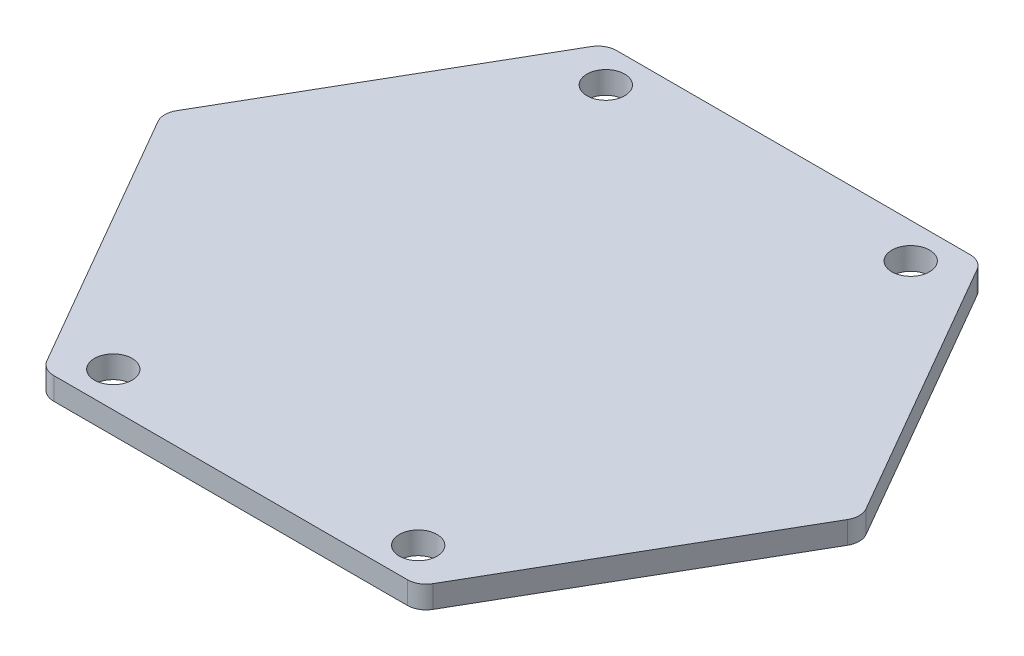
ISO-10303-21;
HEADER;
FILE_DESCRIPTION(('STEP AP214'),'2;1');
FILE_NAME('part.step','',(''),(''),'','','');
FILE_SCHEMA(('AUTOMOTIVE_DESIGN { 1 0 10303 214 1 1 1 1 }'));
ENDSEC;
DATA;
#1=APPLICATION_CONTEXT('core data for automotive mechanical design processes');
#2=APPLICATION_PROTOCOL_DEFINITION('international standard','automotive_design',2000,#1);
#3=PRODUCT_CONTEXT('',#1,'mechanical');
#4=PRODUCT('Part','Part','',(#3));
#5=PRODUCT_RELATED_PRODUCT_CATEGORY('part','',(#4));
#6=PRODUCT_DEFINITION_FORMATION('','',#4);
#7=PRODUCT_DEFINITION_CONTEXT('part definition',#1,'design');
#8=PRODUCT_DEFINITION('design','',#6,#7);
#9=PRODUCT_DEFINITION_SHAPE('','',#8);
#10=(LENGTH_UNIT() NAMED_UNIT(*) SI_UNIT(.MILLI.,.METRE.));
#11=(NAMED_UNIT(*) PLANE_ANGLE_UNIT() SI_UNIT($,.RADIAN.));
#12=(NAMED_UNIT(*) SI_UNIT($,.STERADIAN.) SOLID_ANGLE_UNIT());
#13=UNCERTAINTY_MEASURE_WITH_UNIT(LENGTH_MEASURE(1.E-05),#10,'distance_accuracy_value','');
#14=(GEOMETRIC_REPRESENTATION_CONTEXT(3) GLOBAL_UNCERTAINTY_ASSIGNED_CONTEXT((#13)) GLOBAL_UNIT_ASSIGNED_CONTEXT((#10,
#11,#12)) REPRESENTATION_CONTEXT('',''));
#15=CARTESIAN_POINT('',(0.,0.,0.));
#16=DIRECTION('',(0.,0.,1.));
#17=DIRECTION('',(1.,0.,0.));
#18=AXIS2_PLACEMENT_3D('',#15,#16,#17);
#19=CARTESIAN_POINT('',(0.,31.8516,0.));
#20=DIRECTION('',(0.,1.,0.));
#21=DIRECTION('',(0.,0.,1.));
#22=AXIS2_PLACEMENT_3D('',#19,#20,#21);
#23=PLANE('',#22);
#24=CARTESIAN_POINT('',(-20.6375,31.8516,138.2395));
#25=DIRECTION('',(0.,1.,0.));
#26=DIRECTION('',(0.,0.,1.));
#27=AXIS2_PLACEMENT_3D('',#24,#25,#26);
#28=CIRCLE('',#27,2.5527);
#29=CARTESIAN_POINT('',(-20.6375,31.8516,140.7922));
#30=VERTEX_POINT('',#29);
#31=EDGE_CURVE('E337',#30,#30,#28,.T.);
#32=ORIENTED_EDGE('',*,*,#31,.F.);
#33=EDGE_LOOP('',(#32));
#34=FACE_BOUND('',#33,.T.);
#35=CARTESIAN_POINT('',(20.6375,31.8516,71.5645));
#36=DIRECTION('',(0.,1.,0.));
#37=DIRECTION('',(0.,0.,1.));
#38=AXIS2_PLACEMENT_3D('',#35,#36,#37);
#39=CIRCLE('',#38,2.5527);
#40=CARTESIAN_POINT('',(20.6375,31.8516,74.1172));
#41=VERTEX_POINT('',#40);
#42=EDGE_CURVE('E270',#41,#41,#39,.T.);
#43=ORIENTED_EDGE('',*,*,#42,.F.);
#44=EDGE_LOOP('',(#43));
#45=FACE_BOUND('',#44,.T.);
#46=DIRECTION('',(-0.500000000000001,0.,0.866025403784438));
#47=VECTOR('',#46,1.);
#48=CARTESIAN_POINT('',(-47.3970452561248,31.8516,104.902));
#49=LINE('',#48,#47);
#50=CARTESIAN_POINT('',(-26.1332348418708,31.8516,68.072));
#51=VERTEX_POINT('',#50);
#52=CARTESIAN_POINT('',(-46.663810414254,31.8516,103.632));
#53=VERTEX_POINT('',#52);
#54=EDGE_CURVE('E259',#51,#53,#49,.T.);
#55=ORIENTED_EDGE('',*,*,#54,.T.);
#56=CARTESIAN_POINT('',(-44.4641058886415,31.8516,104.902));
#57=DIRECTION('',(0.,1.,0.));
#58=DIRECTION('',(0.,0.,1.));
#59=AXIS2_PLACEMENT_3D('',#56,#57,#58);
#60=CIRCLE('',#59,2.54);
#61=CARTESIAN_POINT('',(-46.663810414254,31.8516,106.172));
#62=VERTEX_POINT('',#61);
#63=EDGE_CURVE('E204',#53,#62,#60,.T.);
#64=ORIENTED_EDGE('',*,*,#63,.T.);
#65=DIRECTION('',(0.500000000000001,0.,0.866025403784438));
#66=VECTOR('',#65,1.);
#67=CARTESIAN_POINT('',(-25.4,31.8516,143.002));
#68=LINE('',#67,#66);
#69=CARTESIAN_POINT('',(-26.1332348418708,31.8516,141.732));
#70=VERTEX_POINT('',#69);
#71=EDGE_CURVE('E149',#62,#70,#68,.T.);
#72=ORIENTED_EDGE('',*,*,#71,.T.);
#73=CARTESIAN_POINT('',(-23.9335303162583,31.8516,140.462));
#74=DIRECTION('',(0.,1.,0.));
#75=DIRECTION('',(0.,0.,1.));
#76=AXIS2_PLACEMENT_3D('',#73,#74,#75);
#77=CIRCLE('',#76,2.54);
#78=CARTESIAN_POINT('',(-23.9335303162583,31.8516,143.002));
#79=VERTEX_POINT('',#78);
#80=EDGE_CURVE('E60',#70,#79,#77,.T.);
#81=ORIENTED_EDGE('',*,*,#80,.T.);
#82=DIRECTION('',(1.,0.,0.));
#83=VECTOR('',#82,1.);
#84=CARTESIAN_POINT('',(-25.4,31.8516,143.002));
#85=LINE('',#84,#83);
#86=CARTESIAN_POINT('',(23.9335303162583,31.8516,143.002));
#87=VERTEX_POINT('',#86);
#88=EDGE_CURVE('E170',#79,#87,#85,.T.);
#89=ORIENTED_EDGE('',*,*,#88,.T.);
#90=CARTESIAN_POINT('',(23.9335303162583,31.8516,140.462));
#91=DIRECTION('',(0.,1.,0.));
#92=DIRECTION('',(0.,0.,1.));
#93=AXIS2_PLACEMENT_3D('',#90,#91,#92);
#94=CIRCLE('',#93,2.54);
#95=CARTESIAN_POINT('',(26.1332348418708,31.8516,141.732));
#96=VERTEX_POINT('',#95);
#97=EDGE_CURVE('E192',#87,#96,#94,.T.);
#98=ORIENTED_EDGE('',*,*,#97,.T.);
#99=DIRECTION('',(0.500000000000001,0.,-0.866025403784438));
#100=VECTOR('',#99,1.);
#101=CARTESIAN_POINT('',(47.3970452561248,31.8516,104.902));
#102=LINE('',#101,#100);
#103=CARTESIAN_POINT('',(46.663810414254,31.8516,106.172));
#104=VERTEX_POINT('',#103);
#105=EDGE_CURVE('E163',#96,#104,#102,.T.);
#106=ORIENTED_EDGE('',*,*,#105,.T.);
#107=CARTESIAN_POINT('',(44.4641058886415,31.8516,104.902));
#108=DIRECTION('',(0.,1.,0.));
#109=DIRECTION('',(0.,0.,1.));
#110=AXIS2_PLACEMENT_3D('',#107,#108,#109);
#111=CIRCLE('',#110,2.54);
#112=CARTESIAN_POINT('',(46.663810414254,31.8516,103.632));
#113=VERTEX_POINT('',#112);
#114=EDGE_CURVE('E195',#104,#113,#111,.T.);
#115=ORIENTED_EDGE('',*,*,#114,.T.);
#116=DIRECTION('',(-0.500000000000001,0.,-0.866025403784438));
#117=VECTOR('',#116,1.);
#118=CARTESIAN_POINT('',(25.4,31.8516,66.802));
#119=LINE('',#118,#117);
#120=CARTESIAN_POINT('',(26.1332348418708,31.8516,68.072));
#121=VERTEX_POINT('',#120);
#122=EDGE_CURVE('E246',#113,#121,#119,.T.);
#123=ORIENTED_EDGE('',*,*,#122,.T.);
#124=CARTESIAN_POINT('',(23.9335303162583,31.8516,69.342));
#125=DIRECTION('',(0.,1.,0.));
#126=DIRECTION('',(0.,0.,1.));
#127=AXIS2_PLACEMENT_3D('',#124,#125,#126);
#128=CIRCLE('',#127,2.54);
#129=CARTESIAN_POINT('',(23.9335303162583,31.8516,66.802));
#130=VERTEX_POINT('',#129);
#131=EDGE_CURVE('E198',#121,#130,#128,.T.);
#132=ORIENTED_EDGE('',*,*,#131,.T.);
#133=DIRECTION('',(-1.,0.,0.));
#134=VECTOR('',#133,1.);
#135=CARTESIAN_POINT('',(-25.4,31.8516,66.802));
#136=LINE('',#135,#134);
#137=CARTESIAN_POINT('',(-23.9335303162584,31.8516,66.802));
#138=VERTEX_POINT('',#137);
#139=EDGE_CURVE('E250',#130,#138,#136,.T.);
#140=ORIENTED_EDGE('',*,*,#139,.T.);
#141=CARTESIAN_POINT('',(-23.9335303162584,31.8516,69.342));
#142=DIRECTION('',(0.,1.,0.));
#143=DIRECTION('',(0.,0.,1.));
#144=AXIS2_PLACEMENT_3D('',#141,#142,#143);
#145=CIRCLE('',#144,2.54);
#146=EDGE_CURVE('E201',#138,#51,#145,.T.);
#147=ORIENTED_EDGE('',*,*,#146,.T.);
#148=EDGE_LOOP('',(#55,#64,#72,#81,#89,#98,#106,#115,#123,#132,#140,#147));
#149=FACE_BOUND('',#148,.T.);
#150=CARTESIAN_POINT('',(-20.6375,31.8516,71.5645));
#151=DIRECTION('',(0.,1.,0.));
#152=DIRECTION('',(0.,0.,1.));
#153=AXIS2_PLACEMENT_3D('',#150,#151,#152);
#154=CIRCLE('',#153,2.5527);
#155=CARTESIAN_POINT('',(-20.6375,31.8516,74.1172));
#156=VERTEX_POINT('',#155);
#157=EDGE_CURVE('E328',#156,#156,#154,.T.);
#158=ORIENTED_EDGE('',*,*,#157,.F.);
#159=EDGE_LOOP('',(#158));
#160=FACE_BOUND('',#159,.T.);
#161=CARTESIAN_POINT('',(20.6375,31.8516,138.2395));
#162=DIRECTION('',(0.,1.,0.));
#163=DIRECTION('',(0.,0.,1.));
#164=AXIS2_PLACEMENT_3D('',#161,#162,#163);
#165=CIRCLE('',#164,2.5527);
#166=CARTESIAN_POINT('',(20.6375,31.8516,140.7922));
#167=VERTEX_POINT('',#166);
#168=EDGE_CURVE('E344',#167,#167,#165,.T.);
#169=ORIENTED_EDGE('',*,*,#168,.F.);
#170=EDGE_LOOP('',(#169));
#171=FACE_BOUND('',#170,.T.);
#172=ADVANCED_FACE('F39',(#34,#45,#149,#160,#171),#23,.T.);
#173=CARTESIAN_POINT('',(0.,28.829,0.));
#174=DIRECTION('',(0.,1.,0.));
#175=DIRECTION('',(0.,0.,1.));
#176=AXIS2_PLACEMENT_3D('',#173,#174,#175);
#177=PLANE('',#176);
#178=DIRECTION('',(0.500000000000001,0.,0.866025403784438));
#179=VECTOR('',#178,1.);
#180=CARTESIAN_POINT('',(-25.4,28.829,143.002));
#181=LINE('',#180,#179);
#182=CARTESIAN_POINT('',(-46.663810414254,28.829,106.172));
#183=VERTEX_POINT('',#182);
#184=CARTESIAN_POINT('',(-26.1332348418708,28.829,141.732));
#185=VERTEX_POINT('',#184);
#186=EDGE_CURVE('E147',#183,#185,#181,.T.);
#187=ORIENTED_EDGE('',*,*,#186,.F.);
#188=CARTESIAN_POINT('',(-44.4641058886415,28.829,104.902));
#189=DIRECTION('',(0.,1.,0.));
#190=DIRECTION('',(0.,0.,1.));
#191=AXIS2_PLACEMENT_3D('',#188,#189,#190);
#192=CIRCLE('',#191,2.54);
#193=CARTESIAN_POINT('',(-46.663810414254,28.829,103.632));
#194=VERTEX_POINT('',#193);
#195=EDGE_CURVE('E129',#183,#194,#192,.F.);
#196=ORIENTED_EDGE('',*,*,#195,.T.);
#197=DIRECTION('',(-0.500000000000001,0.,0.866025403784438));
#198=VECTOR('',#197,1.);
#199=CARTESIAN_POINT('',(-47.3970452561248,28.829,104.902));
#200=LINE('',#199,#198);
#201=CARTESIAN_POINT('',(-26.1332348418708,28.829,68.072));
#202=VERTEX_POINT('',#201);
#203=EDGE_CURVE('E159',#202,#194,#200,.T.);
#204=ORIENTED_EDGE('',*,*,#203,.F.);
#205=CARTESIAN_POINT('',(-23.9335303162584,28.829,69.342));
#206=DIRECTION('',(0.,1.,0.));
#207=DIRECTION('',(0.,0.,1.));
#208=AXIS2_PLACEMENT_3D('',#205,#206,#207);
#209=CIRCLE('',#208,2.54);
#210=CARTESIAN_POINT('',(-23.9335303162584,28.829,66.802));
#211=VERTEX_POINT('',#210);
#212=EDGE_CURVE('E141',#202,#211,#209,.F.);
#213=ORIENTED_EDGE('',*,*,#212,.T.);
#214=DIRECTION('',(-1.,0.,0.));
#215=VECTOR('',#214,1.);
#216=CARTESIAN_POINT('',(-25.4,28.829,66.802));
#217=LINE('',#216,#215);
#218=CARTESIAN_POINT('',(23.9335303162583,28.829,66.802));
#219=VERTEX_POINT('',#218);
#220=EDGE_CURVE('E165',#219,#211,#217,.T.);
#221=ORIENTED_EDGE('',*,*,#220,.F.);
#222=CARTESIAN_POINT('',(23.9335303162583,28.829,69.342));
#223=DIRECTION('',(0.,1.,0.));
#224=DIRECTION('',(0.,0.,1.));
#225=AXIS2_PLACEMENT_3D('',#222,#223,#224);
#226=CIRCLE('',#225,2.54);
#227=CARTESIAN_POINT('',(26.1332348418708,28.829,68.072));
#228=VERTEX_POINT('',#227);
#229=EDGE_CURVE('E180',#219,#228,#226,.F.);
#230=ORIENTED_EDGE('',*,*,#229,.T.);
#231=DIRECTION('',(-0.500000000000001,0.,-0.866025403784438));
#232=VECTOR('',#231,1.);
#233=CARTESIAN_POINT('',(25.4,28.829,66.802));
#234=LINE('',#233,#232);
#235=CARTESIAN_POINT('',(46.663810414254,28.829,103.632));
#236=VERTEX_POINT('',#235);
#237=EDGE_CURVE('E269',#236,#228,#234,.T.);
#238=ORIENTED_EDGE('',*,*,#237,.F.);
#239=CARTESIAN_POINT('',(44.4641058886415,28.829,104.902));
#240=DIRECTION('',(0.,1.,0.));
#241=DIRECTION('',(0.,0.,1.));
#242=AXIS2_PLACEMENT_3D('',#239,#240,#241);
#243=CIRCLE('',#242,2.54);
#244=CARTESIAN_POINT('',(46.663810414254,28.829,106.172));
#245=VERTEX_POINT('',#244);
#246=EDGE_CURVE('E177',#236,#245,#243,.F.);
#247=ORIENTED_EDGE('',*,*,#246,.T.);
#248=DIRECTION('',(0.500000000000001,0.,-0.866025403784438));
#249=VECTOR('',#248,1.);
#250=CARTESIAN_POINT('',(47.3970452561248,28.829,104.902));
#251=LINE('',#250,#249);
#252=CARTESIAN_POINT('',(26.1332348418708,28.829,141.732));
#253=VERTEX_POINT('',#252);
#254=EDGE_CURVE('E234',#253,#245,#251,.T.);
#255=ORIENTED_EDGE('',*,*,#254,.F.);
#256=CARTESIAN_POINT('',(23.9335303162583,28.829,140.462));
#257=DIRECTION('',(0.,1.,0.));
#258=DIRECTION('',(0.,0.,1.));
#259=AXIS2_PLACEMENT_3D('',#256,#257,#258);
#260=CIRCLE('',#259,2.54);
#261=CARTESIAN_POINT('',(23.9335303162583,28.829,143.002));
#262=VERTEX_POINT('',#261);
#263=EDGE_CURVE('E174',#253,#262,#260,.F.);
#264=ORIENTED_EDGE('',*,*,#263,.T.);
#265=DIRECTION('',(1.,0.,0.));
#266=VECTOR('',#265,1.);
#267=CARTESIAN_POINT('',(-25.4,28.829,143.002));
#268=LINE('',#267,#266);
#269=CARTESIAN_POINT('',(-23.9335303162583,28.829,143.002));
#270=VERTEX_POINT('',#269);
#271=EDGE_CURVE('E158',#270,#262,#268,.T.);
#272=ORIENTED_EDGE('',*,*,#271,.F.);
#273=CARTESIAN_POINT('',(-23.9335303162583,28.829,140.462));
#274=DIRECTION('',(0.,1.,0.));
#275=DIRECTION('',(0.,0.,1.));
#276=AXIS2_PLACEMENT_3D('',#273,#274,#275);
#277=CIRCLE('',#276,2.54);
#278=EDGE_CURVE('E151',#270,#185,#277,.F.);
#279=ORIENTED_EDGE('',*,*,#278,.T.);
#280=EDGE_LOOP('',(#187,#196,#204,#213,#221,#230,#238,#247,#255,#264,#272,#279));
#281=FACE_BOUND('',#280,.T.);
#282=CARTESIAN_POINT('',(20.6375,28.829,71.5645));
#283=DIRECTION('',(0.,1.,0.));
#284=DIRECTION('',(0.,0.,1.));
#285=AXIS2_PLACEMENT_3D('',#282,#283,#284);
#286=CIRCLE('',#285,2.5527);
#287=CARTESIAN_POINT('',(20.6375,28.829,74.1172));
#288=VERTEX_POINT('',#287);
#289=EDGE_CURVE('E253',#288,#288,#286,.T.);
#290=ORIENTED_EDGE('',*,*,#289,.T.);
#291=EDGE_LOOP('',(#290));
#292=FACE_BOUND('',#291,.T.);
#293=CARTESIAN_POINT('',(-20.6375,28.829,71.5645));
#294=DIRECTION('',(0.,1.,0.));
#295=DIRECTION('',(0.,0.,1.));
#296=AXIS2_PLACEMENT_3D('',#293,#294,#295);
#297=CIRCLE('',#296,2.5527);
#298=CARTESIAN_POINT('',(-20.6375,28.829,74.1172));
#299=VERTEX_POINT('',#298);
#300=EDGE_CURVE('E332',#299,#299,#297,.T.);
#301=ORIENTED_EDGE('',*,*,#300,.T.);
#302=EDGE_LOOP('',(#301));
#303=FACE_BOUND('',#302,.T.);
#304=CARTESIAN_POINT('',(-20.6375,28.829,138.2395));
#305=DIRECTION('',(0.,1.,0.));
#306=DIRECTION('',(0.,0.,1.));
#307=AXIS2_PLACEMENT_3D('',#304,#305,#306);
#308=CIRCLE('',#307,2.5527);
#309=CARTESIAN_POINT('',(-20.6375,28.829,140.7922));
#310=VERTEX_POINT('',#309);
#311=EDGE_CURVE('E340',#310,#310,#308,.T.);
#312=ORIENTED_EDGE('',*,*,#311,.T.);
#313=EDGE_LOOP('',(#312));
#314=FACE_BOUND('',#313,.T.);
#315=CARTESIAN_POINT('',(20.6375,28.829,138.2395));
#316=DIRECTION('',(0.,1.,0.));
#317=DIRECTION('',(0.,0.,1.));
#318=AXIS2_PLACEMENT_3D('',#315,#316,#317);
#319=CIRCLE('',#318,2.5527);
#320=CARTESIAN_POINT('',(20.6375,28.829,140.7922));
#321=VERTEX_POINT('',#320);
#322=EDGE_CURVE('E348',#321,#321,#319,.T.);
#323=ORIENTED_EDGE('',*,*,#322,.T.);
#324=EDGE_LOOP('',(#323));
#325=FACE_BOUND('',#324,.T.);
#326=ADVANCED_FACE('F154',(#281,#292,#303,#314,#325),#177,.F.);
#327=CARTESIAN_POINT('',(47.3970452561248,31.8516,104.902));
#328=DIRECTION('',(-0.866025403784438,0.,-0.500000000000001));
#329=DIRECTION('',(-0.500000000000001,0.,0.866025403784438));
#330=AXIS2_PLACEMENT_3D('',#327,#328,#329);
#331=PLANE('',#330);
#332=ORIENTED_EDGE('',*,*,#254,.T.);
#333=DIRECTION('',(0.,-1.,0.));
#334=VECTOR('',#333,1.);
#335=CARTESIAN_POINT('',(46.663810414254,31.8516,106.172));
#336=LINE('',#335,#334);
#337=EDGE_CURVE('E225',#245,#104,#336,.F.);
#338=ORIENTED_EDGE('',*,*,#337,.T.);
#339=ORIENTED_EDGE('',*,*,#105,.F.);
#340=DIRECTION('',(0.,-1.,0.));
#341=VECTOR('',#340,1.);
#342=CARTESIAN_POINT('',(26.1332348418708,31.8516,141.732));
#343=LINE('',#342,#341);
#344=EDGE_CURVE('E221',#96,#253,#343,.T.);
#345=ORIENTED_EDGE('',*,*,#344,.T.);
#346=EDGE_LOOP('',(#332,#338,#339,#345));
#347=FACE_BOUND('',#346,.T.);
#348=ADVANCED_FACE('F241',(#347),#331,.F.);
#349=CARTESIAN_POINT('',(25.4,31.8516,66.802));
#350=DIRECTION('',(-0.866025403784438,0.,0.500000000000001));
#351=DIRECTION('',(0.500000000000001,0.,0.866025403784438));
#352=AXIS2_PLACEMENT_3D('',#349,#350,#351);
#353=PLANE('',#352);
#354=ORIENTED_EDGE('',*,*,#237,.T.);
#355=DIRECTION('',(0.,-1.,0.));
#356=VECTOR('',#355,1.);
#357=CARTESIAN_POINT('',(26.1332348418708,31.8516,68.072));
#358=LINE('',#357,#356);
#359=EDGE_CURVE('E218',#228,#121,#358,.F.);
#360=ORIENTED_EDGE('',*,*,#359,.T.);
#361=ORIENTED_EDGE('',*,*,#122,.F.);
#362=DIRECTION('',(0.,-1.,0.));
#363=VECTOR('',#362,1.);
#364=CARTESIAN_POINT('',(46.663810414254,31.8516,103.632));
#365=LINE('',#364,#363);
#366=EDGE_CURVE('E214',#113,#236,#365,.T.);
#367=ORIENTED_EDGE('',*,*,#366,.T.);
#368=EDGE_LOOP('',(#354,#360,#361,#367));
#369=FACE_BOUND('',#368,.T.);
#370=ADVANCED_FACE('F296',(#369),#353,.F.);
#371=CARTESIAN_POINT('',(-25.4,31.8516,66.802));
#372=DIRECTION('',(0.,0.,1.));
#373=DIRECTION('',(1.,0.,0.));
#374=AXIS2_PLACEMENT_3D('',#371,#372,#373);
#375=PLANE('',#374);
#376=ORIENTED_EDGE('',*,*,#220,.T.);
#377=DIRECTION('',(0.,-1.,0.));
#378=VECTOR('',#377,1.);
#379=CARTESIAN_POINT('',(-23.9335303162584,31.8516,66.802));
#380=LINE('',#379,#378);
#381=EDGE_CURVE('E211',#211,#138,#380,.F.);
#382=ORIENTED_EDGE('',*,*,#381,.T.);
#383=ORIENTED_EDGE('',*,*,#139,.F.);
#384=DIRECTION('',(0.,-1.,0.));
#385=VECTOR('',#384,1.);
#386=CARTESIAN_POINT('',(23.9335303162583,31.8516,66.802));
#387=LINE('',#386,#385);
#388=EDGE_CURVE('E207',#130,#219,#387,.T.);
#389=ORIENTED_EDGE('',*,*,#388,.T.);
#390=EDGE_LOOP('',(#376,#382,#383,#389));
#391=FACE_BOUND('',#390,.T.);
#392=ADVANCED_FACE('F278',(#391),#375,.F.);
#393=CARTESIAN_POINT('',(-47.3970452561248,31.8516,104.902));
#394=DIRECTION('',(0.866025403784438,0.,0.500000000000001));
#395=DIRECTION('',(0.500000000000001,0.,-0.866025403784438));
#396=AXIS2_PLACEMENT_3D('',#393,#394,#395);
#397=PLANE('',#396);
#398=ORIENTED_EDGE('',*,*,#203,.T.);
#399=DIRECTION('',(0.,-1.,0.));
#400=VECTOR('',#399,1.);
#401=CARTESIAN_POINT('',(-46.663810414254,31.8516,103.632));
#402=LINE('',#401,#400);
#403=EDGE_CURVE('E134',#194,#53,#402,.F.);
#404=ORIENTED_EDGE('',*,*,#403,.T.);
#405=ORIENTED_EDGE('',*,*,#54,.F.);
#406=DIRECTION('',(0.,-1.,0.));
#407=VECTOR('',#406,1.);
#408=CARTESIAN_POINT('',(-26.1332348418708,31.8516,68.072));
#409=LINE('',#408,#407);
#410=EDGE_CURVE('E140',#51,#202,#409,.T.);
#411=ORIENTED_EDGE('',*,*,#410,.T.);
#412=EDGE_LOOP('',(#398,#404,#405,#411));
#413=FACE_BOUND('',#412,.T.);
#414=ADVANCED_FACE('F288',(#413),#397,.F.);
#415=CARTESIAN_POINT('',(-25.4,31.8516,143.002));
#416=DIRECTION('',(0.866025403784438,0.,-0.500000000000001));
#417=DIRECTION('',(-0.500000000000001,0.,-0.866025403784438));
#418=AXIS2_PLACEMENT_3D('',#415,#416,#417);
#419=PLANE('',#418);
#420=ORIENTED_EDGE('',*,*,#71,.F.);
#421=DIRECTION('',(0.,-1.,0.));
#422=VECTOR('',#421,1.);
#423=CARTESIAN_POINT('',(-46.663810414254,31.8516,106.172));
#424=LINE('',#423,#422);
#425=EDGE_CURVE('E133',#62,#183,#424,.T.);
#426=ORIENTED_EDGE('',*,*,#425,.T.);
#427=ORIENTED_EDGE('',*,*,#186,.T.);
#428=DIRECTION('',(0.,-1.,0.));
#429=VECTOR('',#428,1.);
#430=CARTESIAN_POINT('',(-26.1332348418708,31.8516,141.732));
#431=LINE('',#430,#429);
#432=EDGE_CURVE('E152',#185,#70,#431,.F.);
#433=ORIENTED_EDGE('',*,*,#432,.T.);
#434=EDGE_LOOP('',(#420,#426,#427,#433));
#435=FACE_BOUND('',#434,.T.);
#436=ADVANCED_FACE('F146',(#435),#419,.F.);
#437=CARTESIAN_POINT('',(-25.4,31.8516,143.002));
#438=DIRECTION('',(0.,0.,-1.));
#439=DIRECTION('',(-1.,0.,0.));
#440=AXIS2_PLACEMENT_3D('',#437,#438,#439);
#441=PLANE('',#440);
#442=ORIENTED_EDGE('',*,*,#271,.T.);
#443=DIRECTION('',(0.,-1.,0.));
#444=VECTOR('',#443,1.);
#445=CARTESIAN_POINT('',(23.9335303162583,31.8516,143.002));
#446=LINE('',#445,#444);
#447=EDGE_CURVE('E11',#262,#87,#446,.F.);
#448=ORIENTED_EDGE('',*,*,#447,.T.);
#449=ORIENTED_EDGE('',*,*,#88,.F.);
#450=DIRECTION('',(0.,-1.,0.));
#451=VECTOR('',#450,1.);
#452=CARTESIAN_POINT('',(-23.9335303162583,31.8516,143.002));
#453=LINE('',#452,#451);
#454=EDGE_CURVE('E48',#79,#270,#453,.T.);
#455=ORIENTED_EDGE('',*,*,#454,.T.);
#456=EDGE_LOOP('',(#442,#448,#449,#455));
#457=FACE_BOUND('',#456,.T.);
#458=ADVANCED_FACE('F230',(#457),#441,.F.);
#459=CARTESIAN_POINT('',(20.6375,31.8516,71.5645));
#460=DIRECTION('',(0.,-1.,0.));
#461=DIRECTION('',(0.,0.,-1.));
#462=AXIS2_PLACEMENT_3D('',#459,#460,#461);
#463=CYLINDRICAL_SURFACE('',#462,2.5527);
#464=ORIENTED_EDGE('',*,*,#42,.T.);
#465=EDGE_LOOP('',(#464));
#466=FACE_BOUND('',#465,.T.);
#467=ORIENTED_EDGE('',*,*,#289,.F.);
#468=EDGE_LOOP('',(#467));
#469=FACE_BOUND('',#468,.T.);
#470=ADVANCED_FACE('F308',(#466,#469),#463,.F.);
#471=CARTESIAN_POINT('',(-20.6375,31.8516,71.5645));
#472=DIRECTION('',(0.,-1.,0.));
#473=DIRECTION('',(0.,0.,-1.));
#474=AXIS2_PLACEMENT_3D('',#471,#472,#473);
#475=CYLINDRICAL_SURFACE('',#474,2.5527);
#476=ORIENTED_EDGE('',*,*,#157,.T.);
#477=EDGE_LOOP('',(#476));
#478=FACE_BOUND('',#477,.T.);
#479=ORIENTED_EDGE('',*,*,#300,.F.);
#480=EDGE_LOOP('',(#479));
#481=FACE_BOUND('',#480,.T.);
#482=ADVANCED_FACE('F315',(#478,#481),#475,.F.);
#483=CARTESIAN_POINT('',(-20.6375,31.8516,138.2395));
#484=DIRECTION('',(0.,-1.,0.));
#485=DIRECTION('',(0.,0.,-1.));
#486=AXIS2_PLACEMENT_3D('',#483,#484,#485);
#487=CYLINDRICAL_SURFACE('',#486,2.5527);
#488=ORIENTED_EDGE('',*,*,#31,.T.);
#489=EDGE_LOOP('',(#488));
#490=FACE_BOUND('',#489,.T.);
#491=ORIENTED_EDGE('',*,*,#311,.F.);
#492=EDGE_LOOP('',(#491));
#493=FACE_BOUND('',#492,.T.);
#494=ADVANCED_FACE('F320',(#490,#493),#487,.F.);
#495=CARTESIAN_POINT('',(20.6375,31.8516,138.2395));
#496=DIRECTION('',(0.,-1.,0.));
#497=DIRECTION('',(0.,0.,-1.));
#498=AXIS2_PLACEMENT_3D('',#495,#496,#497);
#499=CYLINDRICAL_SURFACE('',#498,2.5527);
#500=ORIENTED_EDGE('',*,*,#168,.T.);
#501=EDGE_LOOP('',(#500));
#502=FACE_BOUND('',#501,.T.);
#503=ORIENTED_EDGE('',*,*,#322,.F.);
#504=EDGE_LOOP('',(#503));
#505=FACE_BOUND('',#504,.T.);
#506=ADVANCED_FACE('F356',(#502,#505),#499,.F.);
#507=CARTESIAN_POINT('',(-44.4641058886415,31.8516,104.902));
#508=DIRECTION('',(0.,-1.,0.));
#509=DIRECTION('',(0.,0.,-1.));
#510=AXIS2_PLACEMENT_3D('',#507,#508,#509);
#511=CYLINDRICAL_SURFACE('',#510,2.54);
#512=ORIENTED_EDGE('',*,*,#63,.F.);
#513=ORIENTED_EDGE('',*,*,#403,.F.);
#514=ORIENTED_EDGE('',*,*,#195,.F.);
#515=ORIENTED_EDGE('',*,*,#425,.F.);
#516=EDGE_LOOP('',(#512,#513,#514,#515));
#517=FACE_BOUND('',#516,.T.);
#518=ADVANCED_FACE('F132',(#517),#511,.T.);
#519=CARTESIAN_POINT('',(-23.9335303162584,31.8516,69.342));
#520=DIRECTION('',(0.,-1.,0.));
#521=DIRECTION('',(0.,0.,-1.));
#522=AXIS2_PLACEMENT_3D('',#519,#520,#521);
#523=CYLINDRICAL_SURFACE('',#522,2.54);
#524=ORIENTED_EDGE('',*,*,#146,.F.);
#525=ORIENTED_EDGE('',*,*,#381,.F.);
#526=ORIENTED_EDGE('',*,*,#212,.F.);
#527=ORIENTED_EDGE('',*,*,#410,.F.);
#528=EDGE_LOOP('',(#524,#525,#526,#527));
#529=FACE_BOUND('',#528,.T.);
#530=ADVANCED_FACE('F283',(#529),#523,.T.);
#531=CARTESIAN_POINT('',(23.9335303162583,31.8516,69.342));
#532=DIRECTION('',(0.,-1.,0.));
#533=DIRECTION('',(0.,0.,-1.));
#534=AXIS2_PLACEMENT_3D('',#531,#532,#533);
#535=CYLINDRICAL_SURFACE('',#534,2.54);
#536=ORIENTED_EDGE('',*,*,#131,.F.);
#537=ORIENTED_EDGE('',*,*,#359,.F.);
#538=ORIENTED_EDGE('',*,*,#229,.F.);
#539=ORIENTED_EDGE('',*,*,#388,.F.);
#540=EDGE_LOOP('',(#536,#537,#538,#539));
#541=FACE_BOUND('',#540,.T.);
#542=ADVANCED_FACE('F446',(#541),#535,.T.);
#543=CARTESIAN_POINT('',(44.4641058886415,31.8516,104.902));
#544=DIRECTION('',(0.,-1.,0.));
#545=DIRECTION('',(0.,0.,-1.));
#546=AXIS2_PLACEMENT_3D('',#543,#544,#545);
#547=CYLINDRICAL_SURFACE('',#546,2.54);
#548=ORIENTED_EDGE('',*,*,#114,.F.);
#549=ORIENTED_EDGE('',*,*,#337,.F.);
#550=ORIENTED_EDGE('',*,*,#246,.F.);
#551=ORIENTED_EDGE('',*,*,#366,.F.);
#552=EDGE_LOOP('',(#548,#549,#550,#551));
#553=FACE_BOUND('',#552,.T.);
#554=ADVANCED_FACE('F454',(#553),#547,.T.);
#555=CARTESIAN_POINT('',(23.9335303162583,31.8516,140.462));
#556=DIRECTION('',(0.,-1.,0.));
#557=DIRECTION('',(0.,0.,-1.));
#558=AXIS2_PLACEMENT_3D('',#555,#556,#557);
#559=CYLINDRICAL_SURFACE('',#558,2.54);
#560=ORIENTED_EDGE('',*,*,#97,.F.);
#561=ORIENTED_EDGE('',*,*,#447,.F.);
#562=ORIENTED_EDGE('',*,*,#263,.F.);
#563=ORIENTED_EDGE('',*,*,#344,.F.);
#564=EDGE_LOOP('',(#560,#561,#562,#563));
#565=FACE_BOUND('',#564,.T.);
#566=ADVANCED_FACE('F238',(#565),#559,.T.);
#567=CARTESIAN_POINT('',(-23.9335303162583,31.8516,140.462));
#568=DIRECTION('',(0.,-1.,0.));
#569=DIRECTION('',(0.,0.,-1.));
#570=AXIS2_PLACEMENT_3D('',#567,#568,#569);
#571=CYLINDRICAL_SURFACE('',#570,2.54);
#572=ORIENTED_EDGE('',*,*,#80,.F.);
#573=ORIENTED_EDGE('',*,*,#432,.F.);
#574=ORIENTED_EDGE('',*,*,#278,.F.);
#575=ORIENTED_EDGE('',*,*,#454,.F.);
#576=EDGE_LOOP('',(#572,#573,#574,#575));
#577=FACE_BOUND('',#576,.T.);
#578=ADVANCED_FACE('F41',(#577),#571,.T.);
#579=CLOSED_SHELL('',(#172,#326,#348,#370,#392,#414,#436,#458,#470,#482,#494,#506,#518,#530,
#542,#554,#566,#578));
#580=MANIFOLD_SOLID_BREP('B2',#579);
#581=ADVANCED_BREP_SHAPE_REPRESENTATION('',(#18,#580),#14);
#582=SHAPE_DEFINITION_REPRESENTATION(#9,#581);
ENDSEC;
END-ISO-10303-21;
